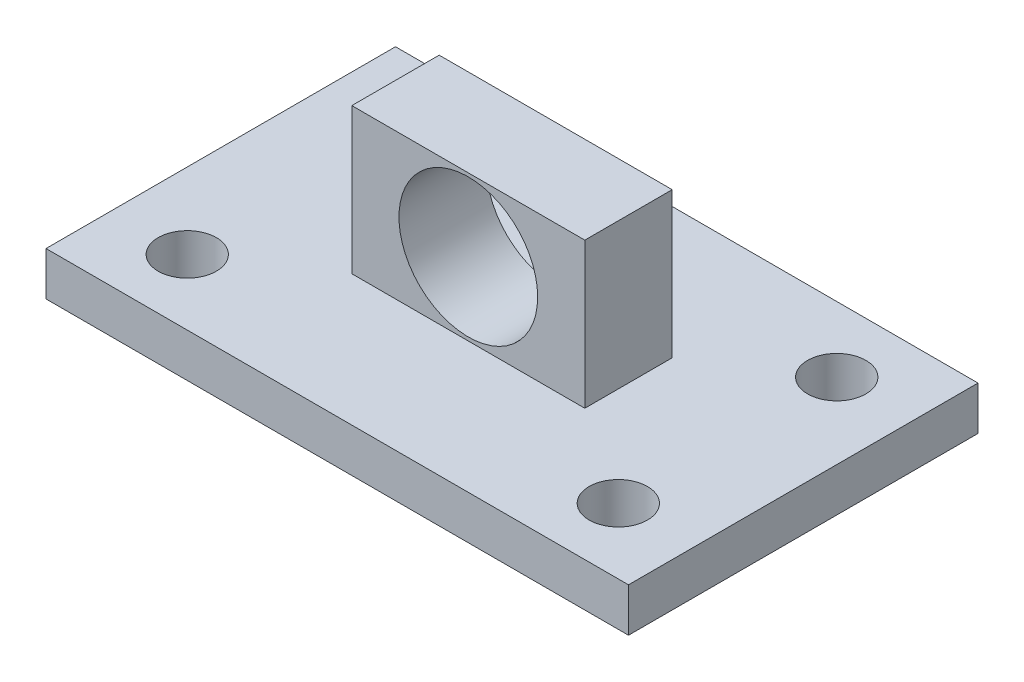
ISO-10303-21;
HEADER;
FILE_DESCRIPTION(('STEP AP214'),'2;1');
FILE_NAME('part.step','',(''),(''),'','','');
FILE_SCHEMA(('AUTOMOTIVE_DESIGN { 1 0 10303 214 1 1 1 1 }'));
ENDSEC;
DATA;
#1=APPLICATION_CONTEXT('core data for automotive mechanical design processes');
#2=APPLICATION_PROTOCOL_DEFINITION('international standard','automotive_design',2000,#1);
#3=PRODUCT_CONTEXT('',#1,'mechanical');
#4=PRODUCT('Part','Part','',(#3));
#5=PRODUCT_RELATED_PRODUCT_CATEGORY('part','',(#4));
#6=PRODUCT_DEFINITION_FORMATION('','',#4);
#7=PRODUCT_DEFINITION_CONTEXT('part definition',#1,'design');
#8=PRODUCT_DEFINITION('design','',#6,#7);
#9=PRODUCT_DEFINITION_SHAPE('','',#8);
#10=(LENGTH_UNIT() NAMED_UNIT(*) SI_UNIT(.MILLI.,.METRE.));
#11=(NAMED_UNIT(*) PLANE_ANGLE_UNIT() SI_UNIT($,.RADIAN.));
#12=(NAMED_UNIT(*) SI_UNIT($,.STERADIAN.) SOLID_ANGLE_UNIT());
#13=UNCERTAINTY_MEASURE_WITH_UNIT(LENGTH_MEASURE(1.E-05),#10,'distance_accuracy_value','');
#14=(GEOMETRIC_REPRESENTATION_CONTEXT(3) GLOBAL_UNCERTAINTY_ASSIGNED_CONTEXT((#13)) GLOBAL_UNIT_ASSIGNED_CONTEXT((#10,
#11,#12)) REPRESENTATION_CONTEXT('',''));
#15=CARTESIAN_POINT('',(0.,0.,0.));
#16=DIRECTION('',(0.,0.,1.));
#17=DIRECTION('',(1.,0.,0.));
#18=AXIS2_PLACEMENT_3D('',#15,#16,#17);
#19=CARTESIAN_POINT('',(0.,3.,0.));
#20=DIRECTION('',(0.,1.,0.));
#21=DIRECTION('',(0.,0.,1.));
#22=AXIS2_PLACEMENT_3D('',#19,#20,#21);
#23=PLANE('',#22);
#24=CARTESIAN_POINT('',(-14.8,3.,-7.5));
#25=DIRECTION('',(0.,1.,0.));
#26=DIRECTION('',(0.,0.,-1.));
#27=AXIS2_PLACEMENT_3D('',#24,#25,#26);
#28=CIRCLE('',#27,2.);
#29=CARTESIAN_POINT('',(-14.8,3.,-9.5));
#30=VERTEX_POINT('',#29);
#31=EDGE_CURVE('E156',#30,#30,#28,.T.);
#32=ORIENTED_EDGE('',*,*,#31,.F.);
#33=EDGE_LOOP('',(#32));
#34=FACE_BOUND('',#33,.T.);
#35=CARTESIAN_POINT('',(-14.8,3.,7.5));
#36=DIRECTION('',(0.,1.,0.));
#37=DIRECTION('',(0.,0.,1.));
#38=AXIS2_PLACEMENT_3D('',#35,#36,#37);
#39=CIRCLE('',#38,2.);
#40=CARTESIAN_POINT('',(-14.8,3.,9.5));
#41=VERTEX_POINT('',#40);
#42=EDGE_CURVE('E172',#41,#41,#39,.T.);
#43=ORIENTED_EDGE('',*,*,#42,.F.);
#44=EDGE_LOOP('',(#43));
#45=FACE_BOUND('',#44,.T.);
#46=DIRECTION('',(0.,0.,-1.));
#47=VECTOR('',#46,1.);
#48=CARTESIAN_POINT('',(20.,3.,-12.));
#49=LINE('',#48,#47);
#50=CARTESIAN_POINT('',(20.,3.,12.));
#51=VERTEX_POINT('',#50);
#52=CARTESIAN_POINT('',(20.,3.,-12.));
#53=VERTEX_POINT('',#52);
#54=EDGE_CURVE('E180',#51,#53,#49,.T.);
#55=ORIENTED_EDGE('',*,*,#54,.T.);
#56=DIRECTION('',(-1.,0.,0.));
#57=VECTOR('',#56,1.);
#58=CARTESIAN_POINT('',(-20.,3.,-12.));
#59=LINE('',#58,#57);
#60=CARTESIAN_POINT('',(-20.,3.,-12.));
#61=VERTEX_POINT('',#60);
#62=EDGE_CURVE('E92',#53,#61,#59,.T.);
#63=ORIENTED_EDGE('',*,*,#62,.T.);
#64=DIRECTION('',(0.,0.,1.));
#65=VECTOR('',#64,1.);
#66=CARTESIAN_POINT('',(-20.,3.,-12.));
#67=LINE('',#66,#65);
#68=CARTESIAN_POINT('',(-20.,3.,12.));
#69=VERTEX_POINT('',#68);
#70=EDGE_CURVE('E185',#61,#69,#67,.T.);
#71=ORIENTED_EDGE('',*,*,#70,.T.);
#72=DIRECTION('',(1.,0.,0.));
#73=VECTOR('',#72,1.);
#74=CARTESIAN_POINT('',(-20.,3.,12.));
#75=LINE('',#74,#73);
#76=EDGE_CURVE('E64',#69,#51,#75,.T.);
#77=ORIENTED_EDGE('',*,*,#76,.T.);
#78=EDGE_LOOP('',(#55,#63,#71,#77));
#79=FACE_BOUND('',#78,.T.);
#80=CARTESIAN_POINT('',(14.8,3.,7.5));
#81=DIRECTION('',(0.,1.,0.));
#82=DIRECTION('',(0.,0.,-1.));
#83=AXIS2_PLACEMENT_3D('',#80,#81,#82);
#84=CIRCLE('',#83,2.);
#85=CARTESIAN_POINT('',(14.8,3.,5.5));
#86=VERTEX_POINT('',#85);
#87=EDGE_CURVE('E164',#86,#86,#84,.T.);
#88=ORIENTED_EDGE('',*,*,#87,.F.);
#89=EDGE_LOOP('',(#88));
#90=FACE_BOUND('',#89,.T.);
#91=CARTESIAN_POINT('',(14.8,3.,-7.5));
#92=DIRECTION('',(0.,1.,0.));
#93=DIRECTION('',(0.,0.,1.));
#94=AXIS2_PLACEMENT_3D('',#91,#92,#93);
#95=CIRCLE('',#94,2.);
#96=CARTESIAN_POINT('',(14.8,3.,-5.5));
#97=VERTEX_POINT('',#96);
#98=EDGE_CURVE('E147',#97,#97,#95,.T.);
#99=ORIENTED_EDGE('',*,*,#98,.F.);
#100=EDGE_LOOP('',(#99));
#101=FACE_BOUND('',#100,.T.);
#102=DIRECTION('',(0.,0.,1.));
#103=VECTOR('',#102,1.);
#104=CARTESIAN_POINT('',(-8.,3.,-3.));
#105=LINE('',#104,#103);
#106=CARTESIAN_POINT('',(-8.,3.,-3.));
#107=VERTEX_POINT('',#106);
#108=CARTESIAN_POINT('',(-8.,3.,3.));
#109=VERTEX_POINT('',#108);
#110=EDGE_CURVE('E284',#107,#109,#105,.T.);
#111=ORIENTED_EDGE('',*,*,#110,.F.);
#112=DIRECTION('',(-1.,0.,0.));
#113=VECTOR('',#112,1.);
#114=CARTESIAN_POINT('',(-8.,3.,-3.));
#115=LINE('',#114,#113);
#116=CARTESIAN_POINT('',(8.,3.,-3.));
#117=VERTEX_POINT('',#116);
#118=EDGE_CURVE('E139',#117,#107,#115,.T.);
#119=ORIENTED_EDGE('',*,*,#118,.F.);
#120=DIRECTION('',(0.,0.,-1.));
#121=VECTOR('',#120,1.);
#122=CARTESIAN_POINT('',(8.,3.,-3.));
#123=LINE('',#122,#121);
#124=CARTESIAN_POINT('',(8.,3.,3.));
#125=VERTEX_POINT('',#124);
#126=EDGE_CURVE('E135',#125,#117,#123,.T.);
#127=ORIENTED_EDGE('',*,*,#126,.F.);
#128=DIRECTION('',(1.,0.,0.));
#129=VECTOR('',#128,1.);
#130=CARTESIAN_POINT('',(-8.,3.,3.));
#131=LINE('',#130,#129);
#132=EDGE_CURVE('E295',#109,#125,#131,.T.);
#133=ORIENTED_EDGE('',*,*,#132,.F.);
#134=EDGE_LOOP('',(#111,#119,#127,#133));
#135=FACE_BOUND('',#134,.T.);
#136=ADVANCED_FACE('F39',(#34,#45,#79,#90,#101,#135),#23,.T.);
#137=CARTESIAN_POINT('',(0.,0.,0.));
#138=DIRECTION('',(0.,1.,0.));
#139=DIRECTION('',(0.,0.,1.));
#140=AXIS2_PLACEMENT_3D('',#137,#138,#139);
#141=PLANE('',#140);
#142=DIRECTION('',(0.,0.,-1.));
#143=VECTOR('',#142,1.);
#144=CARTESIAN_POINT('',(20.,0.,-12.));
#145=LINE('',#144,#143);
#146=CARTESIAN_POINT('',(20.,0.,12.));
#147=VERTEX_POINT('',#146);
#148=CARTESIAN_POINT('',(20.,0.,-12.));
#149=VERTEX_POINT('',#148);
#150=EDGE_CURVE('E176',#147,#149,#145,.T.);
#151=ORIENTED_EDGE('',*,*,#150,.F.);
#152=DIRECTION('',(1.,0.,0.));
#153=VECTOR('',#152,1.);
#154=CARTESIAN_POINT('',(-20.,0.,12.));
#155=LINE('',#154,#153);
#156=CARTESIAN_POINT('',(-20.,0.,12.));
#157=VERTEX_POINT('',#156);
#158=EDGE_CURVE('E85',#157,#147,#155,.T.);
#159=ORIENTED_EDGE('',*,*,#158,.F.);
#160=DIRECTION('',(0.,0.,1.));
#161=VECTOR('',#160,1.);
#162=CARTESIAN_POINT('',(-20.,0.,-12.));
#163=LINE('',#162,#161);
#164=CARTESIAN_POINT('',(-20.,0.,-12.));
#165=VERTEX_POINT('',#164);
#166=EDGE_CURVE('E197',#165,#157,#163,.T.);
#167=ORIENTED_EDGE('',*,*,#166,.F.);
#168=DIRECTION('',(-1.,0.,0.));
#169=VECTOR('',#168,1.);
#170=CARTESIAN_POINT('',(-20.,0.,-12.));
#171=LINE('',#170,#169);
#172=EDGE_CURVE('E194',#149,#165,#171,.T.);
#173=ORIENTED_EDGE('',*,*,#172,.F.);
#174=EDGE_LOOP('',(#151,#159,#167,#173));
#175=FACE_BOUND('',#174,.T.);
#176=CARTESIAN_POINT('',(-14.8,0.,7.5));
#177=DIRECTION('',(0.,1.,0.));
#178=DIRECTION('',(0.,0.,1.));
#179=AXIS2_PLACEMENT_3D('',#176,#177,#178);
#180=CIRCLE('',#179,2.);
#181=CARTESIAN_POINT('',(-14.8,0.,9.5));
#182=VERTEX_POINT('',#181);
#183=EDGE_CURVE('E168',#182,#182,#180,.T.);
#184=ORIENTED_EDGE('',*,*,#183,.T.);
#185=EDGE_LOOP('',(#184));
#186=FACE_BOUND('',#185,.T.);
#187=CARTESIAN_POINT('',(14.8,0.,7.5));
#188=DIRECTION('',(0.,1.,0.));
#189=DIRECTION('',(0.,0.,-1.));
#190=AXIS2_PLACEMENT_3D('',#187,#188,#189);
#191=CIRCLE('',#190,2.);
#192=CARTESIAN_POINT('',(14.8,0.,5.5));
#193=VERTEX_POINT('',#192);
#194=EDGE_CURVE('E160',#193,#193,#191,.T.);
#195=ORIENTED_EDGE('',*,*,#194,.T.);
#196=EDGE_LOOP('',(#195));
#197=FACE_BOUND('',#196,.T.);
#198=CARTESIAN_POINT('',(-14.8,0.,-7.5));
#199=DIRECTION('',(0.,1.,0.));
#200=DIRECTION('',(0.,0.,-1.));
#201=AXIS2_PLACEMENT_3D('',#198,#199,#200);
#202=CIRCLE('',#201,2.);
#203=CARTESIAN_POINT('',(-14.8,0.,-9.5));
#204=VERTEX_POINT('',#203);
#205=EDGE_CURVE('E154',#204,#204,#202,.T.);
#206=ORIENTED_EDGE('',*,*,#205,.T.);
#207=EDGE_LOOP('',(#206));
#208=FACE_BOUND('',#207,.T.);
#209=CARTESIAN_POINT('',(14.8,0.,-7.5));
#210=DIRECTION('',(0.,1.,0.));
#211=DIRECTION('',(0.,0.,1.));
#212=AXIS2_PLACEMENT_3D('',#209,#210,#211);
#213=CIRCLE('',#212,2.);
#214=CARTESIAN_POINT('',(14.8,0.,-5.5));
#215=VERTEX_POINT('',#214);
#216=EDGE_CURVE('E142',#215,#215,#213,.T.);
#217=ORIENTED_EDGE('',*,*,#216,.T.);
#218=EDGE_LOOP('',(#217));
#219=FACE_BOUND('',#218,.T.);
#220=ADVANCED_FACE('F215',(#175,#186,#197,#208,#219),#141,.F.);
#221=CARTESIAN_POINT('',(20.,3.,-12.));
#222=DIRECTION('',(-1.,0.,0.));
#223=DIRECTION('',(0.,0.,1.));
#224=AXIS2_PLACEMENT_3D('',#221,#222,#223);
#225=PLANE('',#224);
#226=ORIENTED_EDGE('',*,*,#150,.T.);
#227=DIRECTION('',(0.,-1.,0.));
#228=VECTOR('',#227,1.);
#229=CARTESIAN_POINT('',(20.,3.,-12.));
#230=LINE('',#229,#228);
#231=EDGE_CURVE('E11',#53,#149,#230,.T.);
#232=ORIENTED_EDGE('',*,*,#231,.F.);
#233=ORIENTED_EDGE('',*,*,#54,.F.);
#234=DIRECTION('',(0.,-1.,0.));
#235=VECTOR('',#234,1.);
#236=CARTESIAN_POINT('',(20.,3.,12.));
#237=LINE('',#236,#235);
#238=EDGE_CURVE('E190',#51,#147,#237,.T.);
#239=ORIENTED_EDGE('',*,*,#238,.T.);
#240=EDGE_LOOP('',(#226,#232,#233,#239));
#241=FACE_BOUND('',#240,.T.);
#242=ADVANCED_FACE('F41',(#241),#225,.F.);
#243=CARTESIAN_POINT('',(-20.,3.,-12.));
#244=DIRECTION('',(0.,0.,1.));
#245=DIRECTION('',(1.,0.,0.));
#246=AXIS2_PLACEMENT_3D('',#243,#244,#245);
#247=PLANE('',#246);
#248=ORIENTED_EDGE('',*,*,#172,.T.);
#249=DIRECTION('',(0.,-1.,0.));
#250=VECTOR('',#249,1.);
#251=CARTESIAN_POINT('',(-20.,3.,-12.));
#252=LINE('',#251,#250);
#253=EDGE_CURVE('E48',#61,#165,#252,.T.);
#254=ORIENTED_EDGE('',*,*,#253,.F.);
#255=ORIENTED_EDGE('',*,*,#62,.F.);
#256=ORIENTED_EDGE('',*,*,#231,.T.);
#257=EDGE_LOOP('',(#248,#254,#255,#256));
#258=FACE_BOUND('',#257,.T.);
#259=ADVANCED_FACE('F231',(#258),#247,.F.);
#260=CARTESIAN_POINT('',(-20.,3.,-12.));
#261=DIRECTION('',(1.,0.,0.));
#262=DIRECTION('',(0.,0.,-1.));
#263=AXIS2_PLACEMENT_3D('',#260,#261,#262);
#264=PLANE('',#263);
#265=ORIENTED_EDGE('',*,*,#166,.T.);
#266=DIRECTION('',(0.,-1.,0.));
#267=VECTOR('',#266,1.);
#268=CARTESIAN_POINT('',(-20.,3.,12.));
#269=LINE('',#268,#267);
#270=EDGE_CURVE('E204',#69,#157,#269,.T.);
#271=ORIENTED_EDGE('',*,*,#270,.F.);
#272=ORIENTED_EDGE('',*,*,#70,.F.);
#273=ORIENTED_EDGE('',*,*,#253,.T.);
#274=EDGE_LOOP('',(#265,#271,#272,#273));
#275=FACE_BOUND('',#274,.T.);
#276=ADVANCED_FACE('F211',(#275),#264,.F.);
#277=CARTESIAN_POINT('',(-20.,3.,12.));
#278=DIRECTION('',(0.,0.,-1.));
#279=DIRECTION('',(-1.,0.,0.));
#280=AXIS2_PLACEMENT_3D('',#277,#278,#279);
#281=PLANE('',#280);
#282=ORIENTED_EDGE('',*,*,#158,.T.);
#283=ORIENTED_EDGE('',*,*,#238,.F.);
#284=ORIENTED_EDGE('',*,*,#76,.F.);
#285=ORIENTED_EDGE('',*,*,#270,.T.);
#286=EDGE_LOOP('',(#282,#283,#284,#285));
#287=FACE_BOUND('',#286,.T.);
#288=ADVANCED_FACE('F220',(#287),#281,.F.);
#289=CARTESIAN_POINT('',(-14.8,3.,7.5));
#290=DIRECTION('',(0.,-1.,0.));
#291=DIRECTION('',(0.,0.,-1.));
#292=AXIS2_PLACEMENT_3D('',#289,#290,#291);
#293=CYLINDRICAL_SURFACE('',#292,2.);
#294=ORIENTED_EDGE('',*,*,#42,.T.);
#295=EDGE_LOOP('',(#294));
#296=FACE_BOUND('',#295,.T.);
#297=ORIENTED_EDGE('',*,*,#183,.F.);
#298=EDGE_LOOP('',(#297));
#299=FACE_BOUND('',#298,.T.);
#300=ADVANCED_FACE('F222',(#296,#299),#293,.F.);
#301=CARTESIAN_POINT('',(14.8,3.,7.5));
#302=DIRECTION('',(0.,-1.,0.));
#303=DIRECTION('',(0.,0.,-1.));
#304=AXIS2_PLACEMENT_3D('',#301,#302,#303);
#305=CYLINDRICAL_SURFACE('',#304,2.);
#306=ORIENTED_EDGE('',*,*,#87,.T.);
#307=EDGE_LOOP('',(#306));
#308=FACE_BOUND('',#307,.T.);
#309=ORIENTED_EDGE('',*,*,#194,.F.);
#310=EDGE_LOOP('',(#309));
#311=FACE_BOUND('',#310,.T.);
#312=ADVANCED_FACE('F228',(#308,#311),#305,.F.);
#313=CARTESIAN_POINT('',(-14.8,3.,-7.5));
#314=DIRECTION('',(0.,-1.,0.));
#315=DIRECTION('',(0.,0.,-1.));
#316=AXIS2_PLACEMENT_3D('',#313,#314,#315);
#317=CYLINDRICAL_SURFACE('',#316,2.);
#318=ORIENTED_EDGE('',*,*,#31,.T.);
#319=EDGE_LOOP('',(#318));
#320=FACE_BOUND('',#319,.T.);
#321=ORIENTED_EDGE('',*,*,#205,.F.);
#322=EDGE_LOOP('',(#321));
#323=FACE_BOUND('',#322,.T.);
#324=ADVANCED_FACE('F245',(#320,#323),#317,.F.);
#325=CARTESIAN_POINT('',(14.8,3.,-7.5));
#326=DIRECTION('',(0.,-1.,0.));
#327=DIRECTION('',(0.,0.,-1.));
#328=AXIS2_PLACEMENT_3D('',#325,#326,#327);
#329=CYLINDRICAL_SURFACE('',#328,2.);
#330=ORIENTED_EDGE('',*,*,#98,.T.);
#331=EDGE_LOOP('',(#330));
#332=FACE_BOUND('',#331,.T.);
#333=ORIENTED_EDGE('',*,*,#216,.F.);
#334=EDGE_LOOP('',(#333));
#335=FACE_BOUND('',#334,.T.);
#336=ADVANCED_FACE('F249',(#332,#335),#329,.F.);
#337=CARTESIAN_POINT('',(-8.,13.,-3.));
#338=DIRECTION('',(0.,0.,1.));
#339=DIRECTION('',(1.,0.,0.));
#340=AXIS2_PLACEMENT_3D('',#337,#338,#339);
#341=PLANE('',#340);
#342=CARTESIAN_POINT('',(0.,8.,-3.));
#343=DIRECTION('',(0.,0.,1.));
#344=DIRECTION('',(1.,0.,0.));
#345=AXIS2_PLACEMENT_3D('',#342,#343,#344);
#346=CIRCLE('',#345,4.7625);
#347=CARTESIAN_POINT('',(4.7625,8.,-3.));
#348=VERTEX_POINT('',#347);
#349=EDGE_CURVE('E279',#348,#348,#346,.T.);
#350=ORIENTED_EDGE('',*,*,#349,.T.);
#351=EDGE_LOOP('',(#350));
#352=FACE_BOUND('',#351,.T.);
#353=ORIENTED_EDGE('',*,*,#118,.T.);
#354=DIRECTION('',(0.,-1.,0.));
#355=VECTOR('',#354,1.);
#356=CARTESIAN_POINT('',(-8.,13.,-3.));
#357=LINE('',#356,#355);
#358=CARTESIAN_POINT('',(-8.,13.,-3.));
#359=VERTEX_POINT('',#358);
#360=EDGE_CURVE('E118',#359,#107,#357,.T.);
#361=ORIENTED_EDGE('',*,*,#360,.F.);
#362=DIRECTION('',(-1.,0.,0.));
#363=VECTOR('',#362,1.);
#364=CARTESIAN_POINT('',(-8.,13.,-3.));
#365=LINE('',#364,#363);
#366=CARTESIAN_POINT('',(8.,13.,-3.));
#367=VERTEX_POINT('',#366);
#368=EDGE_CURVE('E126',#367,#359,#365,.T.);
#369=ORIENTED_EDGE('',*,*,#368,.F.);
#370=DIRECTION('',(0.,-1.,0.));
#371=VECTOR('',#370,1.);
#372=CARTESIAN_POINT('',(8.,13.,-3.));
#373=LINE('',#372,#371);
#374=EDGE_CURVE('E291',#367,#117,#373,.T.);
#375=ORIENTED_EDGE('',*,*,#374,.T.);
#376=EDGE_LOOP('',(#353,#361,#369,#375));
#377=FACE_BOUND('',#376,.T.);
#378=ADVANCED_FACE('F137',(#352,#377),#341,.F.);
#379=CARTESIAN_POINT('',(-8.,13.,-3.));
#380=DIRECTION('',(1.,0.,0.));
#381=DIRECTION('',(0.,0.,-1.));
#382=AXIS2_PLACEMENT_3D('',#379,#380,#381);
#383=PLANE('',#382);
#384=ORIENTED_EDGE('',*,*,#110,.T.);
#385=DIRECTION('',(0.,-1.,0.));
#386=VECTOR('',#385,1.);
#387=CARTESIAN_POINT('',(-8.,13.,3.));
#388=LINE('',#387,#386);
#389=CARTESIAN_POINT('',(-8.,13.,3.));
#390=VERTEX_POINT('',#389);
#391=EDGE_CURVE('E121',#390,#109,#388,.T.);
#392=ORIENTED_EDGE('',*,*,#391,.F.);
#393=DIRECTION('',(0.,0.,1.));
#394=VECTOR('',#393,1.);
#395=CARTESIAN_POINT('',(-8.,13.,-3.));
#396=LINE('',#395,#394);
#397=EDGE_CURVE('E114',#359,#390,#396,.T.);
#398=ORIENTED_EDGE('',*,*,#397,.F.);
#399=ORIENTED_EDGE('',*,*,#360,.T.);
#400=EDGE_LOOP('',(#384,#392,#398,#399));
#401=FACE_BOUND('',#400,.T.);
#402=ADVANCED_FACE('F116',(#401),#383,.F.);
#403=CARTESIAN_POINT('',(-8.,13.,3.));
#404=DIRECTION('',(0.,0.,-1.));
#405=DIRECTION('',(-1.,0.,0.));
#406=AXIS2_PLACEMENT_3D('',#403,#404,#405);
#407=PLANE('',#406);
#408=CARTESIAN_POINT('',(0.,8.,3.));
#409=DIRECTION('',(0.,0.,1.));
#410=DIRECTION('',(1.,0.,0.));
#411=AXIS2_PLACEMENT_3D('',#408,#409,#410);
#412=CIRCLE('',#411,4.7625);
#413=CARTESIAN_POINT('',(4.7625,8.,3.));
#414=VERTEX_POINT('',#413);
#415=EDGE_CURVE('E276',#414,#414,#412,.T.);
#416=ORIENTED_EDGE('',*,*,#415,.F.);
#417=EDGE_LOOP('',(#416));
#418=FACE_BOUND('',#417,.T.);
#419=ORIENTED_EDGE('',*,*,#132,.T.);
#420=DIRECTION('',(0.,-1.,0.));
#421=VECTOR('',#420,1.);
#422=CARTESIAN_POINT('',(8.,13.,3.));
#423=LINE('',#422,#421);
#424=CARTESIAN_POINT('',(8.,13.,3.));
#425=VERTEX_POINT('',#424);
#426=EDGE_CURVE('E55',#425,#125,#423,.T.);
#427=ORIENTED_EDGE('',*,*,#426,.F.);
#428=DIRECTION('',(1.,0.,0.));
#429=VECTOR('',#428,1.);
#430=CARTESIAN_POINT('',(-8.,13.,3.));
#431=LINE('',#430,#429);
#432=EDGE_CURVE('E125',#390,#425,#431,.T.);
#433=ORIENTED_EDGE('',*,*,#432,.F.);
#434=ORIENTED_EDGE('',*,*,#391,.T.);
#435=EDGE_LOOP('',(#419,#427,#433,#434));
#436=FACE_BOUND('',#435,.T.);
#437=ADVANCED_FACE('F259',(#418,#436),#407,.F.);
#438=CARTESIAN_POINT('',(8.,13.,-3.));
#439=DIRECTION('',(-1.,0.,0.));
#440=DIRECTION('',(0.,0.,1.));
#441=AXIS2_PLACEMENT_3D('',#438,#439,#440);
#442=PLANE('',#441);
#443=ORIENTED_EDGE('',*,*,#126,.T.);
#444=ORIENTED_EDGE('',*,*,#374,.F.);
#445=DIRECTION('',(0.,0.,-1.));
#446=VECTOR('',#445,1.);
#447=CARTESIAN_POINT('',(8.,13.,-3.));
#448=LINE('',#447,#446);
#449=EDGE_CURVE('E130',#425,#367,#448,.T.);
#450=ORIENTED_EDGE('',*,*,#449,.F.);
#451=ORIENTED_EDGE('',*,*,#426,.T.);
#452=EDGE_LOOP('',(#443,#444,#450,#451));
#453=FACE_BOUND('',#452,.T.);
#454=ADVANCED_FACE('F262',(#453),#442,.F.);
#455=CARTESIAN_POINT('',(0.,13.,0.));
#456=DIRECTION('',(0.,-1.,0.));
#457=DIRECTION('',(0.,0.,-1.));
#458=AXIS2_PLACEMENT_3D('',#455,#456,#457);
#459=PLANE('',#458);
#460=ORIENTED_EDGE('',*,*,#368,.T.);
#461=ORIENTED_EDGE('',*,*,#397,.T.);
#462=ORIENTED_EDGE('',*,*,#432,.T.);
#463=ORIENTED_EDGE('',*,*,#449,.T.);
#464=EDGE_LOOP('',(#460,#461,#462,#463));
#465=FACE_BOUND('',#464,.T.);
#466=ADVANCED_FACE('F129',(#465),#459,.F.);
#467=CARTESIAN_POINT('',(0.,8.,-7.));
#468=DIRECTION('',(0.,0.,1.));
#469=DIRECTION('',(1.,0.,0.));
#470=AXIS2_PLACEMENT_3D('',#467,#468,#469);
#471=CYLINDRICAL_SURFACE('',#470,4.7625);
#472=ORIENTED_EDGE('',*,*,#415,.T.);
#473=EDGE_LOOP('',(#472));
#474=FACE_BOUND('',#473,.T.);
#475=ORIENTED_EDGE('',*,*,#349,.F.);
#476=EDGE_LOOP('',(#475));
#477=FACE_BOUND('',#476,.T.);
#478=ADVANCED_FACE('F268',(#474,#477),#471,.F.);
#479=CLOSED_SHELL('',(#136,#220,#242,#259,#276,#288,#300,#312,#324,#336,#378,#402,#437,#454,
#466,#478));
#480=MANIFOLD_SOLID_BREP('B2',#479);
#481=ADVANCED_BREP_SHAPE_REPRESENTATION('',(#18,#480),#14);
#482=SHAPE_DEFINITION_REPRESENTATION(#9,#481);
ENDSEC;
END-ISO-10303-21;
